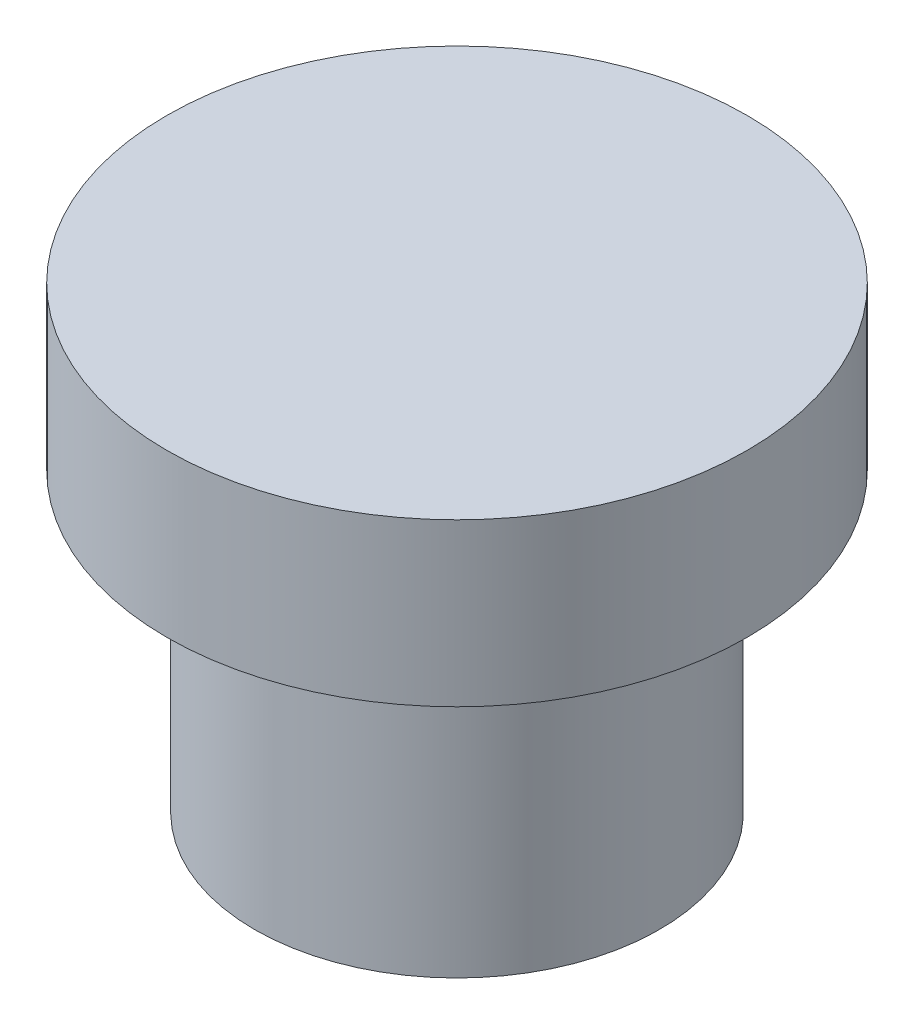
ISO-10303-21;
HEADER;
FILE_DESCRIPTION(('STEP AP214'),'2;1');
FILE_NAME('part.step','',(''),(''),'','','');
FILE_SCHEMA(('AUTOMOTIVE_DESIGN { 1 0 10303 214 1 1 1 1 }'));
ENDSEC;
DATA;
#1=APPLICATION_CONTEXT('core data for automotive mechanical design processes');
#2=APPLICATION_PROTOCOL_DEFINITION('international standard','automotive_design',2000,#1);
#3=PRODUCT_CONTEXT('',#1,'mechanical');
#4=PRODUCT('Part','Part','',(#3));
#5=PRODUCT_RELATED_PRODUCT_CATEGORY('part','',(#4));
#6=PRODUCT_DEFINITION_FORMATION('','',#4);
#7=PRODUCT_DEFINITION_CONTEXT('part definition',#1,'design');
#8=PRODUCT_DEFINITION('design','',#6,#7);
#9=PRODUCT_DEFINITION_SHAPE('','',#8);
#10=(LENGTH_UNIT() NAMED_UNIT(*) SI_UNIT(.MILLI.,.METRE.));
#11=(NAMED_UNIT(*) PLANE_ANGLE_UNIT() SI_UNIT($,.RADIAN.));
#12=(NAMED_UNIT(*) SI_UNIT($,.STERADIAN.) SOLID_ANGLE_UNIT());
#13=UNCERTAINTY_MEASURE_WITH_UNIT(LENGTH_MEASURE(1.E-05),#10,'distance_accuracy_value','');
#14=(GEOMETRIC_REPRESENTATION_CONTEXT(3) GLOBAL_UNCERTAINTY_ASSIGNED_CONTEXT((#13)) GLOBAL_UNIT_ASSIGNED_CONTEXT((#10,
#11,#12)) REPRESENTATION_CONTEXT('',''));
#15=CARTESIAN_POINT('',(0.,0.,0.));
#16=DIRECTION('',(0.,0.,1.));
#17=DIRECTION('',(1.,0.,0.));
#18=AXIS2_PLACEMENT_3D('',#15,#16,#17);
#19=CARTESIAN_POINT('',(0.,11.,0.));
#20=DIRECTION('',(0.,-1.,0.));
#21=DIRECTION('',(0.,0.,-1.));
#22=AXIS2_PLACEMENT_3D('',#19,#20,#21);
#23=CYLINDRICAL_SURFACE('',#22,7.5);
#24=CARTESIAN_POINT('',(0.,11.,0.));
#25=DIRECTION('',(0.,1.,0.));
#26=DIRECTION('',(0.,0.,1.));
#27=AXIS2_PLACEMENT_3D('',#24,#25,#26);
#28=CIRCLE('',#27,7.5);
#29=CARTESIAN_POINT('',(0.,11.,7.5));
#30=VERTEX_POINT('',#29);
#31=EDGE_CURVE('E10',#30,#30,#28,.T.);
#32=ORIENTED_EDGE('',*,*,#31,.F.);
#33=EDGE_LOOP('',(#32));
#34=FACE_BOUND('',#33,.T.);
#35=CARTESIAN_POINT('',(0.,0.,0.));
#36=DIRECTION('',(0.,1.,0.));
#37=DIRECTION('',(0.,0.,1.));
#38=AXIS2_PLACEMENT_3D('',#35,#36,#37);
#39=CIRCLE('',#38,7.5);
#40=CARTESIAN_POINT('',(0.,0.,7.5));
#41=VERTEX_POINT('',#40);
#42=EDGE_CURVE('E36',#41,#41,#39,.T.);
#43=ORIENTED_EDGE('',*,*,#42,.T.);
#44=EDGE_LOOP('',(#43));
#45=FACE_BOUND('',#44,.T.);
#46=ADVANCED_FACE('F33',(#34,#45),#23,.T.);
#47=CARTESIAN_POINT('',(0.,0.,0.));
#48=DIRECTION('',(0.,1.,0.));
#49=DIRECTION('',(0.,0.,1.));
#50=AXIS2_PLACEMENT_3D('',#47,#48,#49);
#51=PLANE('',#50);
#52=ORIENTED_EDGE('',*,*,#42,.F.);
#53=EDGE_LOOP('',(#52));
#54=FACE_BOUND('',#53,.T.);
#55=ADVANCED_FACE('F56',(#54),#51,.F.);
#56=CARTESIAN_POINT('',(0.,17.,0.));
#57=DIRECTION('',(0.,-1.,0.));
#58=DIRECTION('',(0.,0.,-1.));
#59=AXIS2_PLACEMENT_3D('',#56,#57,#58);
#60=CYLINDRICAL_SURFACE('',#59,10.75);
#61=CARTESIAN_POINT('',(0.,17.,0.));
#62=DIRECTION('',(0.,1.,0.));
#63=DIRECTION('',(0.,0.,1.));
#64=AXIS2_PLACEMENT_3D('',#61,#62,#63);
#65=CIRCLE('',#64,10.75);
#66=CARTESIAN_POINT('',(0.,17.,10.75));
#67=VERTEX_POINT('',#66);
#68=EDGE_CURVE('E43',#67,#67,#65,.T.);
#69=ORIENTED_EDGE('',*,*,#68,.F.);
#70=EDGE_LOOP('',(#69));
#71=FACE_BOUND('',#70,.T.);
#72=CARTESIAN_POINT('',(0.,11.,0.));
#73=DIRECTION('',(0.,1.,0.));
#74=DIRECTION('',(0.,0.,1.));
#75=AXIS2_PLACEMENT_3D('',#72,#73,#74);
#76=CIRCLE('',#75,10.75);
#77=CARTESIAN_POINT('',(0.,11.,10.75));
#78=VERTEX_POINT('',#77);
#79=EDGE_CURVE('E45',#78,#78,#76,.T.);
#80=ORIENTED_EDGE('',*,*,#79,.T.);
#81=EDGE_LOOP('',(#80));
#82=FACE_BOUND('',#81,.T.);
#83=ADVANCED_FACE('F53',(#71,#82),#60,.T.);
#84=CARTESIAN_POINT('',(0.,17.,0.));
#85=DIRECTION('',(0.,1.,0.));
#86=DIRECTION('',(0.,0.,1.));
#87=AXIS2_PLACEMENT_3D('',#84,#85,#86);
#88=PLANE('',#87);
#89=ORIENTED_EDGE('',*,*,#68,.T.);
#90=EDGE_LOOP('',(#89));
#91=FACE_BOUND('',#90,.T.);
#92=ADVANCED_FACE('F51',(#91),#88,.T.);
#93=CARTESIAN_POINT('',(0.,11.,0.));
#94=DIRECTION('',(0.,1.,0.));
#95=DIRECTION('',(0.,0.,1.));
#96=AXIS2_PLACEMENT_3D('',#93,#94,#95);
#97=PLANE('',#96);
#98=ORIENTED_EDGE('',*,*,#31,.T.);
#99=EDGE_LOOP('',(#98));
#100=FACE_BOUND('',#99,.T.);
#101=ORIENTED_EDGE('',*,*,#79,.F.);
#102=EDGE_LOOP('',(#101));
#103=FACE_BOUND('',#102,.T.);
#104=ADVANCED_FACE('F60',(#100,#103),#97,.F.);
#105=CLOSED_SHELL('',(#46,#55,#83,#92,#104));
#106=MANIFOLD_SOLID_BREP('B2',#105);
#107=ADVANCED_BREP_SHAPE_REPRESENTATION('',(#18,#106),#14);
#108=SHAPE_DEFINITION_REPRESENTATION(#9,#107);
ENDSEC;
END-ISO-10303-21;
